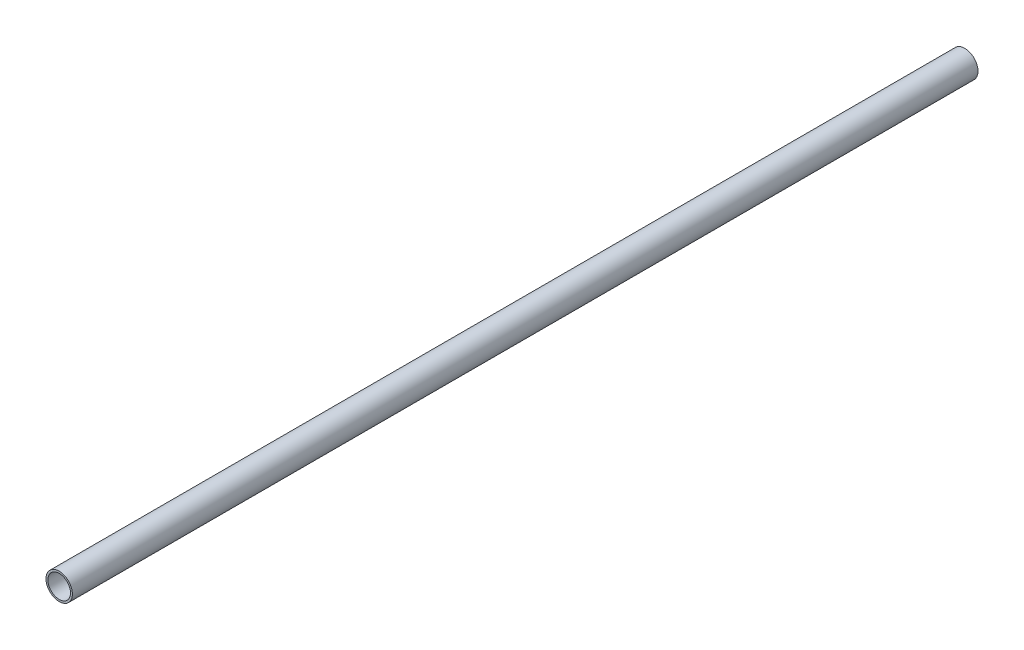
ISO-10303-21;
HEADER;
FILE_DESCRIPTION(('STEP AP214'),'2;1');
FILE_NAME('part.step','',(''),(''),'','','');
FILE_SCHEMA(('AUTOMOTIVE_DESIGN { 1 0 10303 214 1 1 1 1 }'));
ENDSEC;
DATA;
#1=APPLICATION_CONTEXT('core data for automotive mechanical design processes');
#2=APPLICATION_PROTOCOL_DEFINITION('international standard','automotive_design',2000,#1);
#3=PRODUCT_CONTEXT('',#1,'mechanical');
#4=PRODUCT('Part','Part','',(#3));
#5=PRODUCT_RELATED_PRODUCT_CATEGORY('part','',(#4));
#6=PRODUCT_DEFINITION_FORMATION('','',#4);
#7=PRODUCT_DEFINITION_CONTEXT('part definition',#1,'design');
#8=PRODUCT_DEFINITION('design','',#6,#7);
#9=PRODUCT_DEFINITION_SHAPE('','',#8);
#10=(LENGTH_UNIT() NAMED_UNIT(*) SI_UNIT(.MILLI.,.METRE.));
#11=(NAMED_UNIT(*) PLANE_ANGLE_UNIT() SI_UNIT($,.RADIAN.));
#12=(NAMED_UNIT(*) SI_UNIT($,.STERADIAN.) SOLID_ANGLE_UNIT());
#13=UNCERTAINTY_MEASURE_WITH_UNIT(LENGTH_MEASURE(1.E-05),#10,'distance_accuracy_value','');
#14=(GEOMETRIC_REPRESENTATION_CONTEXT(3) GLOBAL_UNCERTAINTY_ASSIGNED_CONTEXT((#13)) GLOBAL_UNIT_ASSIGNED_CONTEXT((#10,
#11,#12)) REPRESENTATION_CONTEXT('',''));
#15=CARTESIAN_POINT('',(0.,0.,0.));
#16=DIRECTION('',(0.,0.,1.));
#17=DIRECTION('',(1.,0.,0.));
#18=AXIS2_PLACEMENT_3D('',#15,#16,#17);
#19=CARTESIAN_POINT('',(0.,0.,1524.));
#20=DIRECTION('',(0.,0.,1.));
#21=DIRECTION('',(1.,0.,0.));
#22=AXIS2_PLACEMENT_3D('',#19,#20,#21);
#23=PLANE('',#22);
#24=CARTESIAN_POINT('',(0.,0.,1524.));
#25=DIRECTION('',(0.,0.,1.));
#26=DIRECTION('',(1.,0.,0.));
#27=AXIS2_PLACEMENT_3D('',#24,#25,#26);
#28=CIRCLE('',#27,44.45);
#29=CARTESIAN_POINT('',(44.45,0.,1524.));
#30=VERTEX_POINT('',#29);
#31=EDGE_CURVE('E10',#30,#30,#28,.T.);
#32=ORIENTED_EDGE('',*,*,#31,.T.);
#33=EDGE_LOOP('',(#32));
#34=FACE_BOUND('',#33,.T.);
#35=CARTESIAN_POINT('',(0.,0.,1524.));
#36=DIRECTION('',(0.,0.,1.));
#37=DIRECTION('',(1.,0.,0.));
#38=AXIS2_PLACEMENT_3D('',#35,#36,#37);
#39=CIRCLE('',#38,38.1);
#40=CARTESIAN_POINT('',(38.1,0.,1524.));
#41=VERTEX_POINT('',#40);
#42=EDGE_CURVE('E42',#41,#41,#39,.T.);
#43=ORIENTED_EDGE('',*,*,#42,.F.);
#44=EDGE_LOOP('',(#43));
#45=FACE_BOUND('',#44,.T.);
#46=ADVANCED_FACE('F31',(#34,#45),#23,.T.);
#47=CARTESIAN_POINT('',(0.,0.,-1524.));
#48=DIRECTION('',(0.,0.,1.));
#49=DIRECTION('',(1.,0.,0.));
#50=AXIS2_PLACEMENT_3D('',#47,#48,#49);
#51=PLANE('',#50);
#52=CARTESIAN_POINT('',(0.,0.,-1524.));
#53=DIRECTION('',(0.,0.,1.));
#54=DIRECTION('',(1.,0.,0.));
#55=AXIS2_PLACEMENT_3D('',#52,#53,#54);
#56=CIRCLE('',#55,44.45);
#57=CARTESIAN_POINT('',(44.45,0.,-1524.));
#58=VERTEX_POINT('',#57);
#59=EDGE_CURVE('E35',#58,#58,#56,.T.);
#60=ORIENTED_EDGE('',*,*,#59,.F.);
#61=EDGE_LOOP('',(#60));
#62=FACE_BOUND('',#61,.T.);
#63=CARTESIAN_POINT('',(0.,0.,-1524.));
#64=DIRECTION('',(0.,0.,1.));
#65=DIRECTION('',(1.,0.,0.));
#66=AXIS2_PLACEMENT_3D('',#63,#64,#65);
#67=CIRCLE('',#66,38.1);
#68=CARTESIAN_POINT('',(38.1,0.,-1524.));
#69=VERTEX_POINT('',#68);
#70=EDGE_CURVE('E44',#69,#69,#67,.T.);
#71=ORIENTED_EDGE('',*,*,#70,.T.);
#72=EDGE_LOOP('',(#71));
#73=FACE_BOUND('',#72,.T.);
#74=ADVANCED_FACE('F54',(#62,#73),#51,.F.);
#75=CARTESIAN_POINT('',(0.,0.,1524.));
#76=DIRECTION('',(0.,0.,-1.));
#77=DIRECTION('',(-1.,0.,0.));
#78=AXIS2_PLACEMENT_3D('',#75,#76,#77);
#79=CYLINDRICAL_SURFACE('',#78,44.45);
#80=ORIENTED_EDGE('',*,*,#31,.F.);
#81=EDGE_LOOP('',(#80));
#82=FACE_BOUND('',#81,.T.);
#83=ORIENTED_EDGE('',*,*,#59,.T.);
#84=EDGE_LOOP('',(#83));
#85=FACE_BOUND('',#84,.T.);
#86=ADVANCED_FACE('F33',(#82,#85),#79,.T.);
#87=CARTESIAN_POINT('',(0.,0.,1524.));
#88=DIRECTION('',(0.,0.,-1.));
#89=DIRECTION('',(-1.,0.,0.));
#90=AXIS2_PLACEMENT_3D('',#87,#88,#89);
#91=CYLINDRICAL_SURFACE('',#90,38.1);
#92=ORIENTED_EDGE('',*,*,#42,.T.);
#93=EDGE_LOOP('',(#92));
#94=FACE_BOUND('',#93,.T.);
#95=ORIENTED_EDGE('',*,*,#70,.F.);
#96=EDGE_LOOP('',(#95));
#97=FACE_BOUND('',#96,.T.);
#98=ADVANCED_FACE('F50',(#94,#97),#91,.F.);
#99=CLOSED_SHELL('',(#46,#74,#86,#98));
#100=MANIFOLD_SOLID_BREP('B2',#99);
#101=ADVANCED_BREP_SHAPE_REPRESENTATION('',(#18,#100),#14);
#102=SHAPE_DEFINITION_REPRESENTATION(#9,#101);
ENDSEC;
END-ISO-10303-21;
